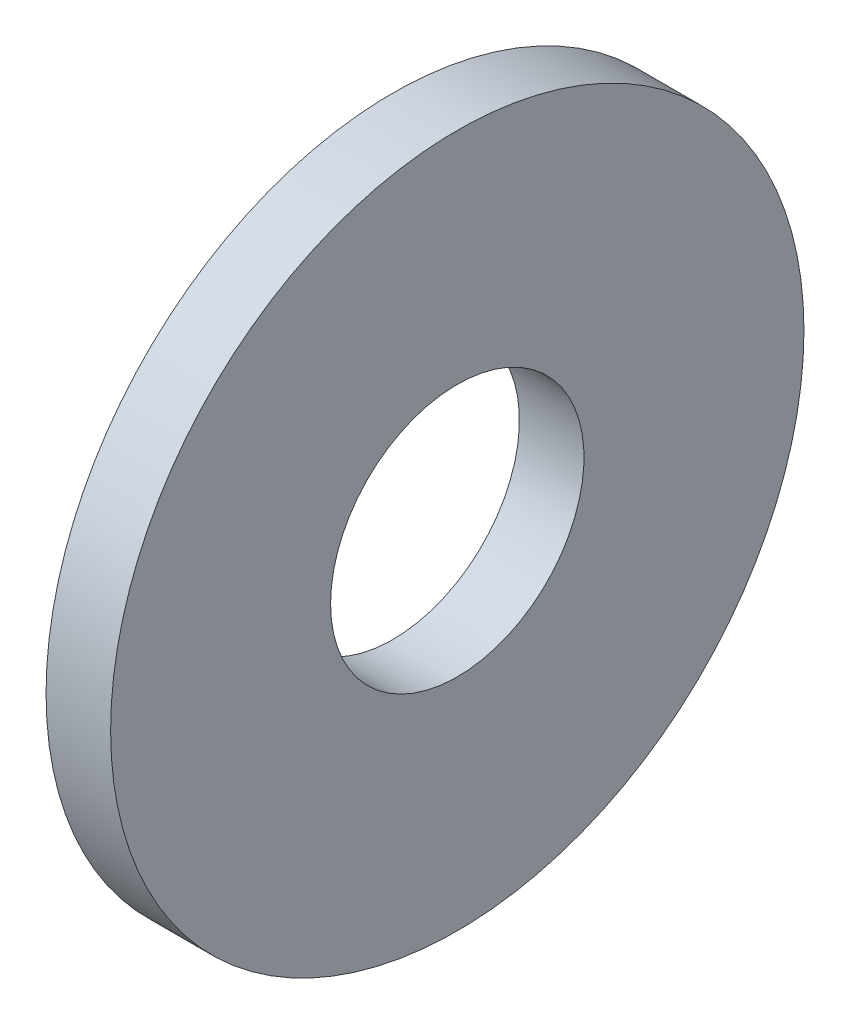
ISO-10303-21;
HEADER;
FILE_DESCRIPTION(('STEP AP214'),'2;1');
FILE_NAME('part.step','',(''),(''),'','','');
FILE_SCHEMA(('AUTOMOTIVE_DESIGN { 1 0 10303 214 1 1 1 1 }'));
ENDSEC;
DATA;
#1=APPLICATION_CONTEXT('core data for automotive mechanical design processes');
#2=APPLICATION_PROTOCOL_DEFINITION('international standard','automotive_design',2000,#1);
#3=PRODUCT_CONTEXT('',#1,'mechanical');
#4=PRODUCT('Part','Part','',(#3));
#5=PRODUCT_RELATED_PRODUCT_CATEGORY('part','',(#4));
#6=PRODUCT_DEFINITION_FORMATION('','',#4);
#7=PRODUCT_DEFINITION_CONTEXT('part definition',#1,'design');
#8=PRODUCT_DEFINITION('design','',#6,#7);
#9=PRODUCT_DEFINITION_SHAPE('','',#8);
#10=(LENGTH_UNIT() NAMED_UNIT(*) SI_UNIT(.MILLI.,.METRE.));
#11=(NAMED_UNIT(*) PLANE_ANGLE_UNIT() SI_UNIT($,.RADIAN.));
#12=(NAMED_UNIT(*) SI_UNIT($,.STERADIAN.) SOLID_ANGLE_UNIT());
#13=UNCERTAINTY_MEASURE_WITH_UNIT(LENGTH_MEASURE(1.E-05),#10,'distance_accuracy_value','');
#14=(GEOMETRIC_REPRESENTATION_CONTEXT(3) GLOBAL_UNCERTAINTY_ASSIGNED_CONTEXT((#13)) GLOBAL_UNIT_ASSIGNED_CONTEXT((#10,
#11,#12)) REPRESENTATION_CONTEXT('',''));
#15=CARTESIAN_POINT('',(0.,0.,0.));
#16=DIRECTION('',(0.,0.,1.));
#17=DIRECTION('',(1.,0.,0.));
#18=AXIS2_PLACEMENT_3D('',#15,#16,#17);
#19=CARTESIAN_POINT('',(-34.9249999999999,0.,0.));
#20=DIRECTION('',(-1.,0.,0.));
#21=DIRECTION('',(0.,0.,1.));
#22=AXIS2_PLACEMENT_3D('',#19,#20,#21);
#23=CYLINDRICAL_SURFACE('',#22,3.435);
#24=CARTESIAN_POINT('',(0.,0.,0.));
#25=DIRECTION('',(-1.,0.,0.));
#26=DIRECTION('',(0.,0.,1.));
#27=AXIS2_PLACEMENT_3D('',#24,#25,#26);
#28=CIRCLE('',#27,3.435);
#29=CARTESIAN_POINT('',(0.,0.,3.435));
#30=VERTEX_POINT('',#29);
#31=EDGE_CURVE('E10',#30,#30,#28,.T.);
#32=ORIENTED_EDGE('',*,*,#31,.F.);
#33=EDGE_LOOP('',(#32));
#34=FACE_BOUND('',#33,.T.);
#35=CARTESIAN_POINT('',(-1.75,0.,0.));
#36=DIRECTION('',(-1.,0.,0.));
#37=DIRECTION('',(0.,0.,1.));
#38=AXIS2_PLACEMENT_3D('',#35,#36,#37);
#39=CIRCLE('',#38,3.435);
#40=CARTESIAN_POINT('',(-1.75,0.,3.435));
#41=VERTEX_POINT('',#40);
#42=EDGE_CURVE('E45',#41,#41,#39,.T.);
#43=ORIENTED_EDGE('',*,*,#42,.T.);
#44=EDGE_LOOP('',(#43));
#45=FACE_BOUND('',#44,.T.);
#46=ADVANCED_FACE('F31',(#34,#45),#23,.F.);
#47=CARTESIAN_POINT('',(0.,3.435,0.));
#48=DIRECTION('',(-1.,0.,0.));
#49=DIRECTION('',(0.,0.,1.));
#50=AXIS2_PLACEMENT_3D('',#47,#48,#49);
#51=PLANE('',#50);
#52=CARTESIAN_POINT('',(0.,0.,0.));
#53=DIRECTION('',(-1.,0.,0.));
#54=DIRECTION('',(0.,0.,1.));
#55=AXIS2_PLACEMENT_3D('',#52,#53,#54);
#56=CIRCLE('',#55,9.4);
#57=CARTESIAN_POINT('',(0.,0.,9.4));
#58=VERTEX_POINT('',#57);
#59=EDGE_CURVE('E37',#58,#58,#56,.T.);
#60=ORIENTED_EDGE('',*,*,#59,.F.);
#61=EDGE_LOOP('',(#60));
#62=FACE_BOUND('',#61,.T.);
#63=ORIENTED_EDGE('',*,*,#31,.T.);
#64=EDGE_LOOP('',(#63));
#65=FACE_BOUND('',#64,.T.);
#66=ADVANCED_FACE('F60',(#62,#65),#51,.F.);
#67=CARTESIAN_POINT('',(-34.9249999999999,0.,0.));
#68=DIRECTION('',(-1.,0.,0.));
#69=DIRECTION('',(0.,0.,1.));
#70=AXIS2_PLACEMENT_3D('',#67,#68,#69);
#71=CYLINDRICAL_SURFACE('',#70,9.4);
#72=CARTESIAN_POINT('',(-1.75,0.,0.));
#73=DIRECTION('',(-1.,0.,0.));
#74=DIRECTION('',(0.,0.,1.));
#75=AXIS2_PLACEMENT_3D('',#72,#73,#74);
#76=CIRCLE('',#75,9.4);
#77=CARTESIAN_POINT('',(-1.75,0.,9.4));
#78=VERTEX_POINT('',#77);
#79=EDGE_CURVE('E41',#78,#78,#76,.T.);
#80=ORIENTED_EDGE('',*,*,#79,.F.);
#81=EDGE_LOOP('',(#80));
#82=FACE_BOUND('',#81,.T.);
#83=ORIENTED_EDGE('',*,*,#59,.T.);
#84=EDGE_LOOP('',(#83));
#85=FACE_BOUND('',#84,.T.);
#86=ADVANCED_FACE('F55',(#82,#85),#71,.T.);
#87=CARTESIAN_POINT('',(-1.75,9.4,0.));
#88=DIRECTION('',(1.,0.,0.));
#89=DIRECTION('',(0.,0.,-1.));
#90=AXIS2_PLACEMENT_3D('',#87,#88,#89);
#91=PLANE('',#90);
#92=ORIENTED_EDGE('',*,*,#42,.F.);
#93=EDGE_LOOP('',(#92));
#94=FACE_BOUND('',#93,.T.);
#95=ORIENTED_EDGE('',*,*,#79,.T.);
#96=EDGE_LOOP('',(#95));
#97=FACE_BOUND('',#96,.T.);
#98=ADVANCED_FACE('F52',(#94,#97),#91,.F.);
#99=CLOSED_SHELL('',(#46,#66,#86,#98));
#100=MANIFOLD_SOLID_BREP('B2',#99);
#101=ADVANCED_BREP_SHAPE_REPRESENTATION('',(#18,#100),#14);
#102=SHAPE_DEFINITION_REPRESENTATION(#9,#101);
ENDSEC;
END-ISO-10303-21;
